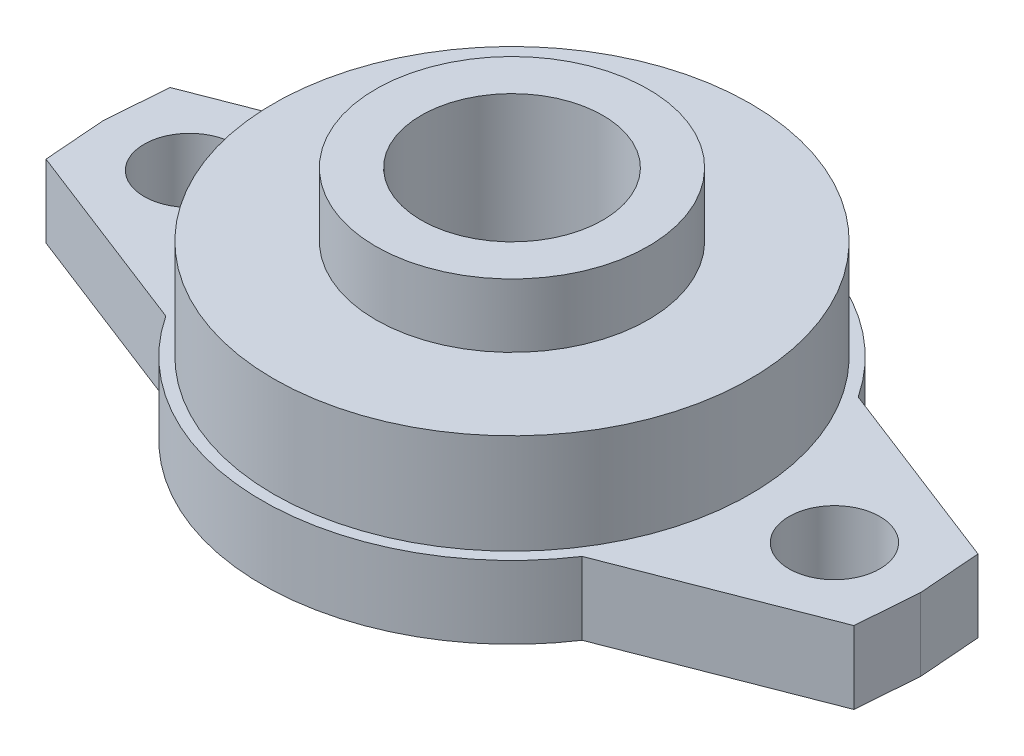
ISO-10303-21;
HEADER;
FILE_DESCRIPTION(('STEP AP214'),'2;1');
FILE_NAME('part.step','',(''),(''),'','','');
FILE_SCHEMA(('AUTOMOTIVE_DESIGN { 1 0 10303 214 1 1 1 1 }'));
ENDSEC;
DATA;
#1=APPLICATION_CONTEXT('core data for automotive mechanical design processes');
#2=APPLICATION_PROTOCOL_DEFINITION('international standard','automotive_design',2000,#1);
#3=PRODUCT_CONTEXT('',#1,'mechanical');
#4=PRODUCT('Part','Part','',(#3));
#5=PRODUCT_RELATED_PRODUCT_CATEGORY('part','',(#4));
#6=PRODUCT_DEFINITION_FORMATION('','',#4);
#7=PRODUCT_DEFINITION_CONTEXT('part definition',#1,'design');
#8=PRODUCT_DEFINITION('design','',#6,#7);
#9=PRODUCT_DEFINITION_SHAPE('','',#8);
#10=(LENGTH_UNIT() NAMED_UNIT(*) SI_UNIT(.MILLI.,.METRE.));
#11=(NAMED_UNIT(*) PLANE_ANGLE_UNIT() SI_UNIT($,.RADIAN.));
#12=(NAMED_UNIT(*) SI_UNIT($,.STERADIAN.) SOLID_ANGLE_UNIT());
#13=UNCERTAINTY_MEASURE_WITH_UNIT(LENGTH_MEASURE(1.E-05),#10,'distance_accuracy_value','');
#14=(GEOMETRIC_REPRESENTATION_CONTEXT(3) GLOBAL_UNCERTAINTY_ASSIGNED_CONTEXT((#13)) GLOBAL_UNIT_ASSIGNED_CONTEXT((#10,
#11,#12)) REPRESENTATION_CONTEXT('',''));
#15=CARTESIAN_POINT('',(0.,0.,0.));
#16=DIRECTION('',(0.,0.,1.));
#17=DIRECTION('',(1.,0.,0.));
#18=AXIS2_PLACEMENT_3D('',#15,#16,#17);
#19=CARTESIAN_POINT('',(0.,8.,0.));
#20=DIRECTION('',(0.,-1.,0.));
#21=DIRECTION('',(0.,0.,-1.));
#22=AXIS2_PLACEMENT_3D('',#19,#20,#21);
#23=CYLINDRICAL_SURFACE('',#22,27.5);
#24=DIRECTION('',(0.,-1.,0.));
#25=VECTOR('',#24,1.);
#26=CARTESIAN_POINT('',(-22.9203732000913,8.,15.1956076669719));
#27=LINE('',#26,#25);
#28=CARTESIAN_POINT('',(-22.9203732000913,0.,15.1956076669719));
#29=VERTEX_POINT('',#28);
#30=CARTESIAN_POINT('',(-22.9203732000913,8.,15.1956076669719));
#31=VERTEX_POINT('',#30);
#32=EDGE_CURVE('E52',#29,#31,#27,.F.);
#33=ORIENTED_EDGE('',*,*,#32,.F.);
#34=CARTESIAN_POINT('',(0.,0.,0.));
#35=DIRECTION('',(0.,1.,0.));
#36=DIRECTION('',(0.,0.,1.));
#37=AXIS2_PLACEMENT_3D('',#34,#35,#36);
#38=CIRCLE('',#37,27.5);
#39=CARTESIAN_POINT('',(22.9203732000913,0.,15.1956076669719));
#40=VERTEX_POINT('',#39);
#41=EDGE_CURVE('E195',#29,#40,#38,.T.);
#42=ORIENTED_EDGE('',*,*,#41,.T.);
#43=DIRECTION('',(0.,-1.,0.));
#44=VECTOR('',#43,1.);
#45=CARTESIAN_POINT('',(22.9203732000913,8.,15.1956076669719));
#46=LINE('',#45,#44);
#47=CARTESIAN_POINT('',(22.9203732000913,8.,15.1956076669719));
#48=VERTEX_POINT('',#47);
#49=EDGE_CURVE('E171',#40,#48,#46,.F.);
#50=ORIENTED_EDGE('',*,*,#49,.T.);
#51=CARTESIAN_POINT('',(0.,8.,0.));
#52=DIRECTION('',(0.,1.,0.));
#53=DIRECTION('',(0.,0.,1.));
#54=AXIS2_PLACEMENT_3D('',#51,#52,#53);
#55=CIRCLE('',#54,27.5);
#56=EDGE_CURVE('E48',#31,#48,#55,.T.);
#57=ORIENTED_EDGE('',*,*,#56,.F.);
#58=EDGE_LOOP('',(#33,#42,#50,#57));
#59=FACE_BOUND('',#58,.T.);
#60=ADVANCED_FACE('F32',(#59),#23,.T.);
#61=CARTESIAN_POINT('',(22.9203732000913,0.,-15.1956076669719));
#62=VERTEX_POINT('',#61);
#63=CARTESIAN_POINT('',(-22.9203732000913,0.,-15.1956076669719));
#64=VERTEX_POINT('',#63);
#65=EDGE_CURVE('E35',#62,#64,#38,.T.);
#66=ORIENTED_EDGE('',*,*,#65,.T.);
#67=DIRECTION('',(0.,-1.,0.));
#68=VECTOR('',#67,1.);
#69=CARTESIAN_POINT('',(-22.9203732000913,8.,-15.1956076669719));
#70=LINE('',#69,#68);
#71=CARTESIAN_POINT('',(-22.9203732000913,8.,-15.1956076669719));
#72=VERTEX_POINT('',#71);
#73=EDGE_CURVE('E149',#64,#72,#70,.F.);
#74=ORIENTED_EDGE('',*,*,#73,.T.);
#75=CARTESIAN_POINT('',(22.9203732000913,8.,-15.1956076669719));
#76=VERTEX_POINT('',#75);
#77=EDGE_CURVE('E197',#76,#72,#55,.T.);
#78=ORIENTED_EDGE('',*,*,#77,.F.);
#79=DIRECTION('',(0.,-1.,0.));
#80=VECTOR('',#79,1.);
#81=CARTESIAN_POINT('',(22.9203732000913,8.,-15.1956076669719));
#82=LINE('',#81,#80);
#83=EDGE_CURVE('E184',#62,#76,#82,.F.);
#84=ORIENTED_EDGE('',*,*,#83,.F.);
#85=EDGE_LOOP('',(#66,#74,#78,#84));
#86=FACE_BOUND('',#85,.T.);
#87=ADVANCED_FACE('F223',(#86),#23,.T.);
#88=CARTESIAN_POINT('',(0.,8.,0.));
#89=DIRECTION('',(0.,1.,0.));
#90=DIRECTION('',(0.,0.,1.));
#91=AXIS2_PLACEMENT_3D('',#88,#89,#90);
#92=PLANE('',#91);
#93=CARTESIAN_POINT('',(-35.5,8.,0.));
#94=DIRECTION('',(0.,-1.,0.));
#95=DIRECTION('',(0.,0.,1.));
#96=AXIS2_PLACEMENT_3D('',#93,#94,#95);
#97=CIRCLE('',#96,5.);
#98=CARTESIAN_POINT('',(-35.5,8.,5.));
#99=VERTEX_POINT('',#98);
#100=EDGE_CURVE('E377',#99,#99,#97,.T.);
#101=ORIENTED_EDGE('',*,*,#100,.T.);
#102=EDGE_LOOP('',(#101));
#103=FACE_BOUND('',#102,.T.);
#104=DIRECTION('',(0.932278966999609,0.,0.361740138345392));
#105=VECTOR('',#104,1.);
#106=CARTESIAN_POINT('',(-20.7943423349889,8.,16.0205439001081));
#107=LINE('',#106,#105);
#108=CARTESIAN_POINT('',(-44.4747314056543,8.,6.83214909370801));
#109=VERTEX_POINT('',#108);
#110=EDGE_CURVE('E107',#109,#31,#107,.T.);
#111=ORIENTED_EDGE('',*,*,#110,.T.);
#112=ORIENTED_EDGE('',*,*,#56,.T.);
#113=DIRECTION('',(-0.932278966999609,0.,0.361740138345392));
#114=VECTOR('',#113,1.);
#115=CARTESIAN_POINT('',(20.7943423349889,8.,16.0205439001081));
#116=LINE('',#115,#114);
#117=CARTESIAN_POINT('',(44.4747314056543,8.,6.83214909370801));
#118=VERTEX_POINT('',#117);
#119=EDGE_CURVE('E168',#118,#48,#116,.T.);
#120=ORIENTED_EDGE('',*,*,#119,.F.);
#121=DIRECTION('',(-0.0766556832452012,0.,0.997057624325802));
#122=VECTOR('',#121,1.);
#123=CARTESIAN_POINT('',(44.4747314056543,8.,6.83214909370801));
#124=LINE('',#123,#122);
#125=CARTESIAN_POINT('',(45.,8.,0.));
#126=VERTEX_POINT('',#125);
#127=EDGE_CURVE('E164',#126,#118,#124,.T.);
#128=ORIENTED_EDGE('',*,*,#127,.F.);
#129=DIRECTION('',(-0.0766556832452012,0.,-0.997057624325802));
#130=VECTOR('',#129,1.);
#131=CARTESIAN_POINT('',(44.4747314056543,8.,-6.83214909370801));
#132=LINE('',#131,#130);
#133=CARTESIAN_POINT('',(44.4747314056543,8.,-6.83214909370801));
#134=VERTEX_POINT('',#133);
#135=EDGE_CURVE('E177',#126,#134,#132,.T.);
#136=ORIENTED_EDGE('',*,*,#135,.T.);
#137=DIRECTION('',(-0.932278966999609,0.,-0.361740138345392));
#138=VECTOR('',#137,1.);
#139=CARTESIAN_POINT('',(20.7943423349889,8.,-16.0205439001081));
#140=LINE('',#139,#138);
#141=EDGE_CURVE('E182',#134,#76,#140,.T.);
#142=ORIENTED_EDGE('',*,*,#141,.T.);
#143=ORIENTED_EDGE('',*,*,#77,.T.);
#144=DIRECTION('',(0.932278966999609,0.,-0.361740138345392));
#145=VECTOR('',#144,1.);
#146=CARTESIAN_POINT('',(-20.7943423349889,8.,-16.0205439001081));
#147=LINE('',#146,#145);
#148=CARTESIAN_POINT('',(-44.4747314056543,8.,-6.83214909370801));
#149=VERTEX_POINT('',#148);
#150=EDGE_CURVE('E144',#149,#72,#147,.T.);
#151=ORIENTED_EDGE('',*,*,#150,.F.);
#152=DIRECTION('',(0.0766556832452012,0.,-0.997057624325802));
#153=VECTOR('',#152,1.);
#154=CARTESIAN_POINT('',(-44.4747314056543,8.,-6.83214909370801));
#155=LINE('',#154,#153);
#156=CARTESIAN_POINT('',(-45.,8.,0.));
#157=VERTEX_POINT('',#156);
#158=EDGE_CURVE('E129',#157,#149,#155,.T.);
#159=ORIENTED_EDGE('',*,*,#158,.F.);
#160=DIRECTION('',(0.0766556832452012,0.,0.997057624325802));
#161=VECTOR('',#160,1.);
#162=CARTESIAN_POINT('',(-44.4747314056543,8.,6.83214909370801));
#163=LINE('',#162,#161);
#164=EDGE_CURVE('E115',#157,#109,#163,.T.);
#165=ORIENTED_EDGE('',*,*,#164,.T.);
#166=EDGE_LOOP('',(#111,#112,#120,#128,#136,#142,#143,#151,#159,#165));
#167=FACE_BOUND('',#166,.T.);
#168=CARTESIAN_POINT('',(0.,8.,0.));
#169=DIRECTION('',(0.,1.,0.));
#170=DIRECTION('',(0.,0.,1.));
#171=AXIS2_PLACEMENT_3D('',#168,#169,#170);
#172=CIRCLE('',#171,26.25);
#173=CARTESIAN_POINT('',(0.,8.,26.25));
#174=VERTEX_POINT('',#173);
#175=EDGE_CURVE('E40',#174,#174,#172,.T.);
#176=ORIENTED_EDGE('',*,*,#175,.F.);
#177=EDGE_LOOP('',(#176));
#178=FACE_BOUND('',#177,.T.);
#179=CARTESIAN_POINT('',(35.5,8.,0.));
#180=DIRECTION('',(0.,1.,0.));
#181=DIRECTION('',(0.,0.,1.));
#182=AXIS2_PLACEMENT_3D('',#179,#180,#181);
#183=CIRCLE('',#182,5.);
#184=CARTESIAN_POINT('',(35.5,8.,5.));
#185=VERTEX_POINT('',#184);
#186=EDGE_CURVE('E152',#185,#185,#183,.T.);
#187=ORIENTED_EDGE('',*,*,#186,.F.);
#188=EDGE_LOOP('',(#187));
#189=FACE_BOUND('',#188,.T.);
#190=ADVANCED_FACE('F126',(#103,#167,#178,#189),#92,.T.);
#191=CARTESIAN_POINT('',(0.,0.,0.));
#192=DIRECTION('',(0.,1.,0.));
#193=DIRECTION('',(0.,0.,1.));
#194=AXIS2_PLACEMENT_3D('',#191,#192,#193);
#195=PLANE('',#194);
#196=CARTESIAN_POINT('',(0.,0.,0.));
#197=DIRECTION('',(0.,1.,0.));
#198=DIRECTION('',(0.,0.,1.));
#199=AXIS2_PLACEMENT_3D('',#196,#197,#198);
#200=CIRCLE('',#199,10.);
#201=CARTESIAN_POINT('',(0.,0.,10.));
#202=VERTEX_POINT('',#201);
#203=EDGE_CURVE('E368',#202,#202,#200,.T.);
#204=ORIENTED_EDGE('',*,*,#203,.T.);
#205=EDGE_LOOP('',(#204));
#206=FACE_BOUND('',#205,.T.);
#207=CARTESIAN_POINT('',(-35.5,0.,0.));
#208=DIRECTION('',(0.,-1.,0.));
#209=DIRECTION('',(0.,0.,1.));
#210=AXIS2_PLACEMENT_3D('',#207,#208,#209);
#211=CIRCLE('',#210,5.);
#212=CARTESIAN_POINT('',(-35.5,0.,5.));
#213=VERTEX_POINT('',#212);
#214=EDGE_CURVE('E379',#213,#213,#211,.T.);
#215=ORIENTED_EDGE('',*,*,#214,.F.);
#216=EDGE_LOOP('',(#215));
#217=FACE_BOUND('',#216,.T.);
#218=ORIENTED_EDGE('',*,*,#41,.F.);
#219=DIRECTION('',(0.932278966999609,0.,0.361740138345392));
#220=VECTOR('',#219,1.);
#221=CARTESIAN_POINT('',(-20.7943423349889,0.,16.0205439001081));
#222=LINE('',#221,#220);
#223=CARTESIAN_POINT('',(-44.4747314056543,0.,6.83214909370801));
#224=VERTEX_POINT('',#223);
#225=EDGE_CURVE('E124',#224,#29,#222,.T.);
#226=ORIENTED_EDGE('',*,*,#225,.F.);
#227=DIRECTION('',(0.0766556832452012,0.,0.997057624325802));
#228=VECTOR('',#227,1.);
#229=CARTESIAN_POINT('',(-44.4747314056543,0.,6.83214909370801));
#230=LINE('',#229,#228);
#231=CARTESIAN_POINT('',(-45.,0.,0.));
#232=VERTEX_POINT('',#231);
#233=EDGE_CURVE('E122',#232,#224,#230,.T.);
#234=ORIENTED_EDGE('',*,*,#233,.F.);
#235=DIRECTION('',(0.0766556832452012,0.,-0.997057624325802));
#236=VECTOR('',#235,1.);
#237=CARTESIAN_POINT('',(-44.4747314056543,0.,-6.83214909370801));
#238=LINE('',#237,#236);
#239=CARTESIAN_POINT('',(-44.4747314056543,0.,-6.83214909370801));
#240=VERTEX_POINT('',#239);
#241=EDGE_CURVE('E136',#232,#240,#238,.T.);
#242=ORIENTED_EDGE('',*,*,#241,.T.);
#243=DIRECTION('',(0.932278966999609,0.,-0.361740138345392));
#244=VECTOR('',#243,1.);
#245=CARTESIAN_POINT('',(-20.7943423349889,0.,-16.0205439001081));
#246=LINE('',#245,#244);
#247=EDGE_CURVE('E139',#240,#64,#246,.T.);
#248=ORIENTED_EDGE('',*,*,#247,.T.);
#249=ORIENTED_EDGE('',*,*,#65,.F.);
#250=DIRECTION('',(-0.932278966999609,0.,-0.361740138345392));
#251=VECTOR('',#250,1.);
#252=CARTESIAN_POINT('',(20.7943423349889,0.,-16.0205439001081));
#253=LINE('',#252,#251);
#254=CARTESIAN_POINT('',(44.4747314056543,0.,-6.83214909370801));
#255=VERTEX_POINT('',#254);
#256=EDGE_CURVE('E175',#255,#62,#253,.T.);
#257=ORIENTED_EDGE('',*,*,#256,.F.);
#258=DIRECTION('',(-0.0766556832452012,0.,-0.997057624325802));
#259=VECTOR('',#258,1.);
#260=CARTESIAN_POINT('',(44.4747314056543,0.,-6.83214909370801));
#261=LINE('',#260,#259);
#262=CARTESIAN_POINT('',(45.,0.,0.));
#263=VERTEX_POINT('',#262);
#264=EDGE_CURVE('E179',#263,#255,#261,.T.);
#265=ORIENTED_EDGE('',*,*,#264,.F.);
#266=DIRECTION('',(-0.0766556832452012,0.,0.997057624325802));
#267=VECTOR('',#266,1.);
#268=CARTESIAN_POINT('',(44.4747314056543,0.,6.83214909370801));
#269=LINE('',#268,#267);
#270=CARTESIAN_POINT('',(44.4747314056543,0.,6.83214909370801));
#271=VERTEX_POINT('',#270);
#272=EDGE_CURVE('E156',#263,#271,#269,.T.);
#273=ORIENTED_EDGE('',*,*,#272,.T.);
#274=DIRECTION('',(-0.932278966999609,0.,0.361740138345392));
#275=VECTOR('',#274,1.);
#276=CARTESIAN_POINT('',(20.7943423349889,0.,16.0205439001081));
#277=LINE('',#276,#275);
#278=EDGE_CURVE('E161',#271,#40,#277,.T.);
#279=ORIENTED_EDGE('',*,*,#278,.T.);
#280=EDGE_LOOP('',(#218,#226,#234,#242,#248,#249,#257,#265,#273,#279));
#281=FACE_BOUND('',#280,.T.);
#282=CARTESIAN_POINT('',(35.5,0.,0.));
#283=DIRECTION('',(0.,1.,0.));
#284=DIRECTION('',(0.,0.,1.));
#285=AXIS2_PLACEMENT_3D('',#282,#283,#284);
#286=CIRCLE('',#285,5.);
#287=CARTESIAN_POINT('',(35.5,0.,5.));
#288=VERTEX_POINT('',#287);
#289=EDGE_CURVE('E153',#288,#288,#286,.T.);
#290=ORIENTED_EDGE('',*,*,#289,.T.);
#291=EDGE_LOOP('',(#290));
#292=FACE_BOUND('',#291,.T.);
#293=ADVANCED_FACE('F210',(#206,#217,#281,#292),#195,.F.);
#294=CARTESIAN_POINT('',(0.,19.,0.));
#295=DIRECTION('',(0.,-1.,0.));
#296=DIRECTION('',(0.,0.,-1.));
#297=AXIS2_PLACEMENT_3D('',#294,#295,#296);
#298=CYLINDRICAL_SURFACE('',#297,26.25);
#299=CARTESIAN_POINT('',(0.,19.,0.));
#300=DIRECTION('',(0.,1.,0.));
#301=DIRECTION('',(0.,0.,1.));
#302=AXIS2_PLACEMENT_3D('',#299,#300,#301);
#303=CIRCLE('',#302,26.25);
#304=CARTESIAN_POINT('',(0.,19.,26.25));
#305=VERTEX_POINT('',#304);
#306=EDGE_CURVE('E192',#305,#305,#303,.T.);
#307=ORIENTED_EDGE('',*,*,#306,.F.);
#308=EDGE_LOOP('',(#307));
#309=FACE_BOUND('',#308,.T.);
#310=ORIENTED_EDGE('',*,*,#175,.T.);
#311=EDGE_LOOP('',(#310));
#312=FACE_BOUND('',#311,.T.);
#313=ADVANCED_FACE('F252',(#309,#312),#298,.T.);
#314=CARTESIAN_POINT('',(0.,19.,0.));
#315=DIRECTION('',(0.,1.,0.));
#316=DIRECTION('',(0.,0.,1.));
#317=AXIS2_PLACEMENT_3D('',#314,#315,#316);
#318=PLANE('',#317);
#319=CARTESIAN_POINT('',(0.,19.,0.));
#320=DIRECTION('',(0.,1.,0.));
#321=DIRECTION('',(0.,0.,1.));
#322=AXIS2_PLACEMENT_3D('',#319,#320,#321);
#323=CIRCLE('',#322,15.);
#324=CARTESIAN_POINT('',(0.,19.,15.));
#325=VERTEX_POINT('',#324);
#326=EDGE_CURVE('E11',#325,#325,#323,.T.);
#327=ORIENTED_EDGE('',*,*,#326,.F.);
#328=EDGE_LOOP('',(#327));
#329=FACE_BOUND('',#328,.T.);
#330=ORIENTED_EDGE('',*,*,#306,.T.);
#331=EDGE_LOOP('',(#330));
#332=FACE_BOUND('',#331,.T.);
#333=ADVANCED_FACE('F258',(#329,#332),#318,.T.);
#334=CARTESIAN_POINT('',(20.7943423349889,37.027085452229,-16.0205439001081));
#335=DIRECTION('',(-0.361740138345392,0.,0.932278966999608));
#336=DIRECTION('',(0.932278966999609,0.,0.361740138345392));
#337=AXIS2_PLACEMENT_3D('',#334,#335,#336);
#338=PLANE('',#337);
#339=ORIENTED_EDGE('',*,*,#256,.T.);
#340=ORIENTED_EDGE('',*,*,#83,.T.);
#341=ORIENTED_EDGE('',*,*,#141,.F.);
#342=DIRECTION('',(0.,-1.,0.));
#343=VECTOR('',#342,1.);
#344=CARTESIAN_POINT('',(44.4747314056543,37.027085452229,-6.83214909370801));
#345=LINE('',#344,#343);
#346=EDGE_CURVE('E178',#134,#255,#345,.T.);
#347=ORIENTED_EDGE('',*,*,#346,.T.);
#348=EDGE_LOOP('',(#339,#340,#341,#347));
#349=FACE_BOUND('',#348,.T.);
#350=ADVANCED_FACE('F222',(#349),#338,.F.);
#351=CARTESIAN_POINT('',(44.4747314056543,37.027085452229,-6.83214909370801));
#352=DIRECTION('',(-0.997057624325802,0.,0.0766556832452012));
#353=DIRECTION('',(0.0766556832452012,0.,0.997057624325802));
#354=AXIS2_PLACEMENT_3D('',#351,#352,#353);
#355=PLANE('',#354);
#356=ORIENTED_EDGE('',*,*,#135,.F.);
#357=DIRECTION('',(0.,-1.,0.));
#358=VECTOR('',#357,1.);
#359=CARTESIAN_POINT('',(45.,37.027085452229,0.));
#360=LINE('',#359,#358);
#361=EDGE_CURVE('E174',#126,#263,#360,.T.);
#362=ORIENTED_EDGE('',*,*,#361,.T.);
#363=ORIENTED_EDGE('',*,*,#264,.T.);
#364=ORIENTED_EDGE('',*,*,#346,.F.);
#365=EDGE_LOOP('',(#356,#362,#363,#364));
#366=FACE_BOUND('',#365,.T.);
#367=ADVANCED_FACE('F219',(#366),#355,.F.);
#368=CARTESIAN_POINT('',(20.7943423349889,37.027085452229,16.0205439001081));
#369=DIRECTION('',(0.361740138345392,0.,0.932278966999608));
#370=DIRECTION('',(0.932278966999609,0.,-0.361740138345392));
#371=AXIS2_PLACEMENT_3D('',#368,#369,#370);
#372=PLANE('',#371);
#373=ORIENTED_EDGE('',*,*,#49,.F.);
#374=ORIENTED_EDGE('',*,*,#278,.F.);
#375=DIRECTION('',(0.,-1.,0.));
#376=VECTOR('',#375,1.);
#377=CARTESIAN_POINT('',(44.4747314056543,37.027085452229,6.83214909370801));
#378=LINE('',#377,#376);
#379=EDGE_CURVE('E167',#118,#271,#378,.T.);
#380=ORIENTED_EDGE('',*,*,#379,.F.);
#381=ORIENTED_EDGE('',*,*,#119,.T.);
#382=EDGE_LOOP('',(#373,#374,#380,#381));
#383=FACE_BOUND('',#382,.T.);
#384=ADVANCED_FACE('F208',(#383),#372,.T.);
#385=CARTESIAN_POINT('',(44.4747314056543,37.027085452229,6.83214909370801));
#386=DIRECTION('',(0.997057624325802,0.,0.0766556832452012));
#387=DIRECTION('',(0.0766556832452012,0.,-0.997057624325802));
#388=AXIS2_PLACEMENT_3D('',#385,#386,#387);
#389=PLANE('',#388);
#390=ORIENTED_EDGE('',*,*,#361,.F.);
#391=ORIENTED_EDGE('',*,*,#127,.T.);
#392=ORIENTED_EDGE('',*,*,#379,.T.);
#393=ORIENTED_EDGE('',*,*,#272,.F.);
#394=EDGE_LOOP('',(#390,#391,#392,#393));
#395=FACE_BOUND('',#394,.T.);
#396=ADVANCED_FACE('F216',(#395),#389,.T.);
#397=CARTESIAN_POINT('',(35.5,0.,0.));
#398=DIRECTION('',(0.,1.,0.));
#399=DIRECTION('',(0.,0.,1.));
#400=AXIS2_PLACEMENT_3D('',#397,#398,#399);
#401=CYLINDRICAL_SURFACE('',#400,5.);
#402=ORIENTED_EDGE('',*,*,#289,.F.);
#403=EDGE_LOOP('',(#402));
#404=FACE_BOUND('',#403,.T.);
#405=ORIENTED_EDGE('',*,*,#186,.T.);
#406=EDGE_LOOP('',(#405));
#407=FACE_BOUND('',#406,.T.);
#408=ADVANCED_FACE('F237',(#404,#407),#401,.F.);
#409=CARTESIAN_POINT('',(-20.7943423349889,37.027085452229,-16.0205439001081));
#410=DIRECTION('',(-0.361740138345392,0.,-0.932278966999608));
#411=DIRECTION('',(-0.932278966999609,0.,0.361740138345392));
#412=AXIS2_PLACEMENT_3D('',#409,#410,#411);
#413=PLANE('',#412);
#414=ORIENTED_EDGE('',*,*,#73,.F.);
#415=ORIENTED_EDGE('',*,*,#247,.F.);
#416=DIRECTION('',(0.,-1.,0.));
#417=VECTOR('',#416,1.);
#418=CARTESIAN_POINT('',(-44.4747314056543,37.027085452229,-6.83214909370801));
#419=LINE('',#418,#417);
#420=EDGE_CURVE('E143',#149,#240,#419,.T.);
#421=ORIENTED_EDGE('',*,*,#420,.F.);
#422=ORIENTED_EDGE('',*,*,#150,.T.);
#423=EDGE_LOOP('',(#414,#415,#421,#422));
#424=FACE_BOUND('',#423,.T.);
#425=ADVANCED_FACE('F226',(#424),#413,.T.);
#426=CARTESIAN_POINT('',(-44.4747314056543,37.027085452229,-6.83214909370801));
#427=DIRECTION('',(-0.997057624325802,0.,-0.0766556832452012));
#428=DIRECTION('',(-0.0766556832452012,0.,0.997057624325802));
#429=AXIS2_PLACEMENT_3D('',#426,#427,#428);
#430=PLANE('',#429);
#431=DIRECTION('',(0.,-1.,0.));
#432=VECTOR('',#431,1.);
#433=CARTESIAN_POINT('',(-45.,37.027085452229,0.));
#434=LINE('',#433,#432);
#435=EDGE_CURVE('E146',#157,#232,#434,.T.);
#436=ORIENTED_EDGE('',*,*,#435,.F.);
#437=ORIENTED_EDGE('',*,*,#158,.T.);
#438=ORIENTED_EDGE('',*,*,#420,.T.);
#439=ORIENTED_EDGE('',*,*,#241,.F.);
#440=EDGE_LOOP('',(#436,#437,#438,#439));
#441=FACE_BOUND('',#440,.T.);
#442=ADVANCED_FACE('F229',(#441),#430,.T.);
#443=CARTESIAN_POINT('',(-20.7943423349889,37.027085452229,16.0205439001081));
#444=DIRECTION('',(0.361740138345392,0.,-0.932278966999608));
#445=DIRECTION('',(-0.932278966999609,0.,-0.361740138345392));
#446=AXIS2_PLACEMENT_3D('',#443,#444,#445);
#447=PLANE('',#446);
#448=ORIENTED_EDGE('',*,*,#225,.T.);
#449=ORIENTED_EDGE('',*,*,#32,.T.);
#450=ORIENTED_EDGE('',*,*,#110,.F.);
#451=DIRECTION('',(0.,-1.,0.));
#452=VECTOR('',#451,1.);
#453=CARTESIAN_POINT('',(-44.4747314056543,37.027085452229,6.83214909370801));
#454=LINE('',#453,#452);
#455=EDGE_CURVE('E111',#109,#224,#454,.T.);
#456=ORIENTED_EDGE('',*,*,#455,.T.);
#457=EDGE_LOOP('',(#448,#449,#450,#456));
#458=FACE_BOUND('',#457,.T.);
#459=ADVANCED_FACE('F110',(#458),#447,.F.);
#460=CARTESIAN_POINT('',(-44.4747314056543,37.027085452229,6.83214909370801));
#461=DIRECTION('',(0.997057624325802,0.,-0.0766556832452012));
#462=DIRECTION('',(-0.0766556832452012,0.,-0.997057624325802));
#463=AXIS2_PLACEMENT_3D('',#460,#461,#462);
#464=PLANE('',#463);
#465=ORIENTED_EDGE('',*,*,#164,.F.);
#466=ORIENTED_EDGE('',*,*,#435,.T.);
#467=ORIENTED_EDGE('',*,*,#233,.T.);
#468=ORIENTED_EDGE('',*,*,#455,.F.);
#469=EDGE_LOOP('',(#465,#466,#467,#468));
#470=FACE_BOUND('',#469,.T.);
#471=ADVANCED_FACE('F119',(#470),#464,.F.);
#472=CARTESIAN_POINT('',(-35.5,0.,0.));
#473=DIRECTION('',(0.,1.,0.));
#474=DIRECTION('',(0.,0.,1.));
#475=AXIS2_PLACEMENT_3D('',#472,#473,#474);
#476=CYLINDRICAL_SURFACE('',#475,5.);
#477=ORIENTED_EDGE('',*,*,#214,.T.);
#478=EDGE_LOOP('',(#477));
#479=FACE_BOUND('',#478,.T.);
#480=ORIENTED_EDGE('',*,*,#100,.F.);
#481=EDGE_LOOP('',(#480));
#482=FACE_BOUND('',#481,.T.);
#483=ADVANCED_FACE('F309',(#479,#482),#476,.F.);
#484=CARTESIAN_POINT('',(0.,26.,0.));
#485=DIRECTION('',(0.,-1.,0.));
#486=DIRECTION('',(0.,0.,-1.));
#487=AXIS2_PLACEMENT_3D('',#484,#485,#486);
#488=CYLINDRICAL_SURFACE('',#487,15.);
#489=CARTESIAN_POINT('',(0.,26.,0.));
#490=DIRECTION('',(0.,1.,0.));
#491=DIRECTION('',(0.,0.,1.));
#492=AXIS2_PLACEMENT_3D('',#489,#490,#491);
#493=CIRCLE('',#492,15.);
#494=CARTESIAN_POINT('',(0.,26.,15.));
#495=VERTEX_POINT('',#494);
#496=EDGE_CURVE('E373',#495,#495,#493,.T.);
#497=ORIENTED_EDGE('',*,*,#496,.F.);
#498=EDGE_LOOP('',(#497));
#499=FACE_BOUND('',#498,.T.);
#500=ORIENTED_EDGE('',*,*,#326,.T.);
#501=EDGE_LOOP('',(#500));
#502=FACE_BOUND('',#501,.T.);
#503=ADVANCED_FACE('F318',(#499,#502),#488,.T.);
#504=CARTESIAN_POINT('',(0.,26.,0.));
#505=DIRECTION('',(0.,1.,0.));
#506=DIRECTION('',(0.,0.,1.));
#507=AXIS2_PLACEMENT_3D('',#504,#505,#506);
#508=PLANE('',#507);
#509=CARTESIAN_POINT('',(0.,26.,0.));
#510=DIRECTION('',(0.,1.,0.));
#511=DIRECTION('',(0.,0.,1.));
#512=AXIS2_PLACEMENT_3D('',#509,#510,#511);
#513=CIRCLE('',#512,10.);
#514=CARTESIAN_POINT('',(0.,26.,10.));
#515=VERTEX_POINT('',#514);
#516=EDGE_CURVE('E371',#515,#515,#513,.T.);
#517=ORIENTED_EDGE('',*,*,#516,.F.);
#518=EDGE_LOOP('',(#517));
#519=FACE_BOUND('',#518,.T.);
#520=ORIENTED_EDGE('',*,*,#496,.T.);
#521=EDGE_LOOP('',(#520));
#522=FACE_BOUND('',#521,.T.);
#523=ADVANCED_FACE('F335',(#519,#522),#508,.T.);
#524=CARTESIAN_POINT('',(0.,0.,0.));
#525=DIRECTION('',(0.,1.,0.));
#526=DIRECTION('',(0.,0.,1.));
#527=AXIS2_PLACEMENT_3D('',#524,#525,#526);
#528=CYLINDRICAL_SURFACE('',#527,10.);
#529=ORIENTED_EDGE('',*,*,#203,.F.);
#530=EDGE_LOOP('',(#529));
#531=FACE_BOUND('',#530,.T.);
#532=ORIENTED_EDGE('',*,*,#516,.T.);
#533=EDGE_LOOP('',(#532));
#534=FACE_BOUND('',#533,.T.);
#535=ADVANCED_FACE('F351',(#531,#534),#528,.F.);
#536=CLOSED_SHELL('',(#60,#87,#190,#293,#313,#333,#350,#367,#384,#396,#408,#425,#442,#459,#471,
#483,#503,#523,#535));
#537=MANIFOLD_SOLID_BREP('B2',#536);
#538=ADVANCED_BREP_SHAPE_REPRESENTATION('',(#18,#537),#14);
#539=SHAPE_DEFINITION_REPRESENTATION(#9,#538);
ENDSEC;
END-ISO-10303-21;
